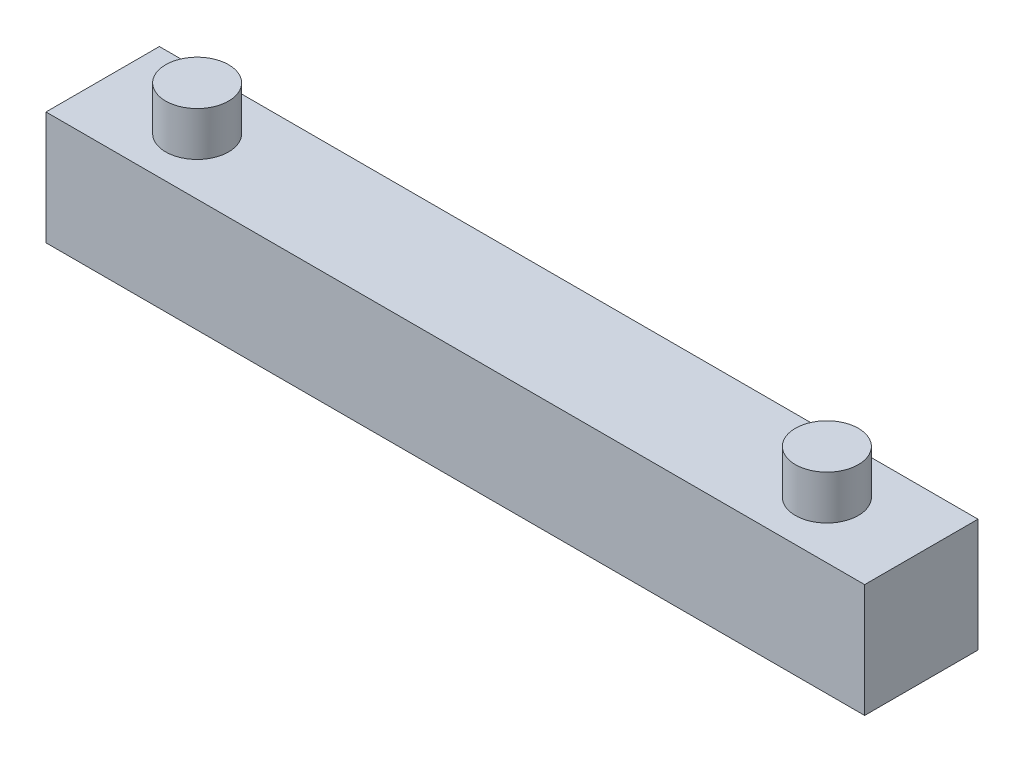
ISO-10303-21;
HEADER;
FILE_DESCRIPTION(('STEP AP214'),'2;1');
FILE_NAME('part.step','',(''),(''),'','','');
FILE_SCHEMA(('AUTOMOTIVE_DESIGN { 1 0 10303 214 1 1 1 1 }'));
ENDSEC;
DATA;
#1=APPLICATION_CONTEXT('core data for automotive mechanical design processes');
#2=APPLICATION_PROTOCOL_DEFINITION('international standard','automotive_design',2000,#1);
#3=PRODUCT_CONTEXT('',#1,'mechanical');
#4=PRODUCT('Part','Part','',(#3));
#5=PRODUCT_RELATED_PRODUCT_CATEGORY('part','',(#4));
#6=PRODUCT_DEFINITION_FORMATION('','',#4);
#7=PRODUCT_DEFINITION_CONTEXT('part definition',#1,'design');
#8=PRODUCT_DEFINITION('design','',#6,#7);
#9=PRODUCT_DEFINITION_SHAPE('','',#8);
#10=(LENGTH_UNIT() NAMED_UNIT(*) SI_UNIT(.MILLI.,.METRE.));
#11=(NAMED_UNIT(*) PLANE_ANGLE_UNIT() SI_UNIT($,.RADIAN.));
#12=(NAMED_UNIT(*) SI_UNIT($,.STERADIAN.) SOLID_ANGLE_UNIT());
#13=UNCERTAINTY_MEASURE_WITH_UNIT(LENGTH_MEASURE(1.E-05),#10,'distance_accuracy_value','');
#14=(GEOMETRIC_REPRESENTATION_CONTEXT(3) GLOBAL_UNCERTAINTY_ASSIGNED_CONTEXT((#13)) GLOBAL_UNIT_ASSIGNED_CONTEXT((#10,
#11,#12)) REPRESENTATION_CONTEXT('',''));
#15=CARTESIAN_POINT('',(0.,0.,0.));
#16=DIRECTION('',(0.,0.,1.));
#17=DIRECTION('',(1.,0.,0.));
#18=AXIS2_PLACEMENT_3D('',#15,#16,#17);
#19=CARTESIAN_POINT('',(0.,9.,0.));
#20=DIRECTION('',(1.,0.,0.));
#21=DIRECTION('',(0.,0.,-1.));
#22=AXIS2_PLACEMENT_3D('',#19,#20,#21);
#23=PLANE('',#22);
#24=DIRECTION('',(0.,0.,1.));
#25=VECTOR('',#24,1.);
#26=CARTESIAN_POINT('',(0.,0.,0.));
#27=LINE('',#26,#25);
#28=CARTESIAN_POINT('',(0.,0.,-9.));
#29=VERTEX_POINT('',#28);
#30=CARTESIAN_POINT('',(0.,0.,0.));
#31=VERTEX_POINT('',#30);
#32=EDGE_CURVE('E100',#29,#31,#27,.T.);
#33=ORIENTED_EDGE('',*,*,#32,.T.);
#34=DIRECTION('',(0.,-1.,0.));
#35=VECTOR('',#34,1.);
#36=CARTESIAN_POINT('',(0.,9.,0.));
#37=LINE('',#36,#35);
#38=CARTESIAN_POINT('',(0.,9.,0.));
#39=VERTEX_POINT('',#38);
#40=EDGE_CURVE('E91',#39,#31,#37,.T.);
#41=ORIENTED_EDGE('',*,*,#40,.F.);
#42=DIRECTION('',(0.,0.,1.));
#43=VECTOR('',#42,1.);
#44=CARTESIAN_POINT('',(0.,9.,0.));
#45=LINE('',#44,#43);
#46=CARTESIAN_POINT('',(0.,9.,-9.));
#47=VERTEX_POINT('',#46);
#48=EDGE_CURVE('E85',#47,#39,#45,.T.);
#49=ORIENTED_EDGE('',*,*,#48,.F.);
#50=DIRECTION('',(0.,-1.,0.));
#51=VECTOR('',#50,1.);
#52=CARTESIAN_POINT('',(0.,9.,-9.));
#53=LINE('',#52,#51);
#54=EDGE_CURVE('E96',#47,#29,#53,.T.);
#55=ORIENTED_EDGE('',*,*,#54,.T.);
#56=EDGE_LOOP('',(#33,#41,#49,#55));
#57=FACE_BOUND('',#56,.T.);
#58=ADVANCED_FACE('F33',(#57),#23,.F.);
#59=CARTESIAN_POINT('',(0.,9.,0.));
#60=DIRECTION('',(0.,0.,-1.));
#61=DIRECTION('',(-1.,0.,0.));
#62=AXIS2_PLACEMENT_3D('',#59,#60,#61);
#63=PLANE('',#62);
#64=DIRECTION('',(1.,0.,0.));
#65=VECTOR('',#64,1.);
#66=CARTESIAN_POINT('',(0.,0.,0.));
#67=LINE('',#66,#65);
#68=CARTESIAN_POINT('',(65.,0.,0.));
#69=VERTEX_POINT('',#68);
#70=EDGE_CURVE('E90',#31,#69,#67,.T.);
#71=ORIENTED_EDGE('',*,*,#70,.T.);
#72=DIRECTION('',(0.,-1.,0.));
#73=VECTOR('',#72,1.);
#74=CARTESIAN_POINT('',(65.,9.,0.));
#75=LINE('',#74,#73);
#76=CARTESIAN_POINT('',(65.,9.,0.));
#77=VERTEX_POINT('',#76);
#78=EDGE_CURVE('E88',#77,#69,#75,.T.);
#79=ORIENTED_EDGE('',*,*,#78,.F.);
#80=DIRECTION('',(1.,0.,0.));
#81=VECTOR('',#80,1.);
#82=CARTESIAN_POINT('',(0.,9.,0.));
#83=LINE('',#82,#81);
#84=EDGE_CURVE('E80',#39,#77,#83,.T.);
#85=ORIENTED_EDGE('',*,*,#84,.F.);
#86=ORIENTED_EDGE('',*,*,#40,.T.);
#87=EDGE_LOOP('',(#71,#79,#85,#86));
#88=FACE_BOUND('',#87,.T.);
#89=ADVANCED_FACE('F89',(#88),#63,.F.);
#90=CARTESIAN_POINT('',(65.,9.,0.));
#91=DIRECTION('',(-1.,0.,0.));
#92=DIRECTION('',(0.,0.,1.));
#93=AXIS2_PLACEMENT_3D('',#90,#91,#92);
#94=PLANE('',#93);
#95=DIRECTION('',(0.,0.,-1.));
#96=VECTOR('',#95,1.);
#97=CARTESIAN_POINT('',(65.,0.,0.));
#98=LINE('',#97,#96);
#99=CARTESIAN_POINT('',(65.,0.,-9.));
#100=VERTEX_POINT('',#99);
#101=EDGE_CURVE('E66',#69,#100,#98,.T.);
#102=ORIENTED_EDGE('',*,*,#101,.T.);
#103=DIRECTION('',(0.,-1.,0.));
#104=VECTOR('',#103,1.);
#105=CARTESIAN_POINT('',(65.,9.,-9.));
#106=LINE('',#105,#104);
#107=CARTESIAN_POINT('',(65.,9.,-9.));
#108=VERTEX_POINT('',#107);
#109=EDGE_CURVE('E92',#108,#100,#106,.T.);
#110=ORIENTED_EDGE('',*,*,#109,.F.);
#111=DIRECTION('',(0.,0.,-1.));
#112=VECTOR('',#111,1.);
#113=CARTESIAN_POINT('',(65.,9.,0.));
#114=LINE('',#113,#112);
#115=EDGE_CURVE('E83',#77,#108,#114,.T.);
#116=ORIENTED_EDGE('',*,*,#115,.F.);
#117=ORIENTED_EDGE('',*,*,#78,.T.);
#118=EDGE_LOOP('',(#102,#110,#116,#117));
#119=FACE_BOUND('',#118,.T.);
#120=ADVANCED_FACE('F94',(#119),#94,.F.);
#121=CARTESIAN_POINT('',(0.,9.,-9.));
#122=DIRECTION('',(0.,0.,1.));
#123=DIRECTION('',(1.,0.,0.));
#124=AXIS2_PLACEMENT_3D('',#121,#122,#123);
#125=PLANE('',#124);
#126=DIRECTION('',(-1.,0.,0.));
#127=VECTOR('',#126,1.);
#128=CARTESIAN_POINT('',(0.,0.,-9.));
#129=LINE('',#128,#127);
#130=EDGE_CURVE('E72',#100,#29,#129,.T.);
#131=ORIENTED_EDGE('',*,*,#130,.T.);
#132=ORIENTED_EDGE('',*,*,#54,.F.);
#133=DIRECTION('',(-1.,0.,0.));
#134=VECTOR('',#133,1.);
#135=CARTESIAN_POINT('',(0.,9.,-9.));
#136=LINE('',#135,#134);
#137=EDGE_CURVE('E49',#108,#47,#136,.T.);
#138=ORIENTED_EDGE('',*,*,#137,.F.);
#139=ORIENTED_EDGE('',*,*,#109,.T.);
#140=EDGE_LOOP('',(#131,#132,#138,#139));
#141=FACE_BOUND('',#140,.T.);
#142=ADVANCED_FACE('F116',(#141),#125,.F.);
#143=CARTESIAN_POINT('',(0.,9.,0.));
#144=DIRECTION('',(0.,-1.,0.));
#145=DIRECTION('',(0.,0.,-1.));
#146=AXIS2_PLACEMENT_3D('',#143,#144,#145);
#147=PLANE('',#146);
#148=CARTESIAN_POINT('',(57.5,9.,-4.50000000000001));
#149=DIRECTION('',(0.,-1.,0.));
#150=DIRECTION('',(0.,0.,-1.));
#151=AXIS2_PLACEMENT_3D('',#148,#149,#150);
#152=CIRCLE('',#151,2.5);
#153=CARTESIAN_POINT('',(57.5,9.,-7.00000000000001));
#154=VERTEX_POINT('',#153);
#155=EDGE_CURVE('E11',#154,#154,#152,.F.);
#156=ORIENTED_EDGE('',*,*,#155,.F.);
#157=EDGE_LOOP('',(#156));
#158=FACE_BOUND('',#157,.T.);
#159=CARTESIAN_POINT('',(7.5,9.,-4.5));
#160=DIRECTION('',(0.,-1.,0.));
#161=DIRECTION('',(0.,0.,-1.));
#162=AXIS2_PLACEMENT_3D('',#159,#160,#161);
#163=CIRCLE('',#162,2.5);
#164=CARTESIAN_POINT('',(7.5,9.,-7.));
#165=VERTEX_POINT('',#164);
#166=EDGE_CURVE('E41',#165,#165,#163,.F.);
#167=ORIENTED_EDGE('',*,*,#166,.F.);
#168=EDGE_LOOP('',(#167));
#169=FACE_BOUND('',#168,.T.);
#170=ORIENTED_EDGE('',*,*,#48,.T.);
#171=ORIENTED_EDGE('',*,*,#84,.T.);
#172=ORIENTED_EDGE('',*,*,#115,.T.);
#173=ORIENTED_EDGE('',*,*,#137,.T.);
#174=EDGE_LOOP('',(#170,#171,#172,#173));
#175=FACE_BOUND('',#174,.T.);
#176=ADVANCED_FACE('F81',(#158,#169,#175),#147,.F.);
#177=CARTESIAN_POINT('',(0.,0.,0.));
#178=DIRECTION('',(0.,-1.,0.));
#179=DIRECTION('',(0.,0.,-1.));
#180=AXIS2_PLACEMENT_3D('',#177,#178,#179);
#181=PLANE('',#180);
#182=ORIENTED_EDGE('',*,*,#32,.F.);
#183=ORIENTED_EDGE('',*,*,#130,.F.);
#184=ORIENTED_EDGE('',*,*,#101,.F.);
#185=ORIENTED_EDGE('',*,*,#70,.F.);
#186=EDGE_LOOP('',(#182,#183,#184,#185));
#187=FACE_BOUND('',#186,.T.);
#188=ADVANCED_FACE('F115',(#187),#181,.T.);
#189=CARTESIAN_POINT('',(7.5,12.5,-4.5));
#190=DIRECTION('',(0.,-1.,0.));
#191=DIRECTION('',(0.,0.,-1.));
#192=AXIS2_PLACEMENT_3D('',#189,#190,#191);
#193=CYLINDRICAL_SURFACE('',#192,2.5);
#194=CARTESIAN_POINT('',(7.5,12.5,-4.5));
#195=DIRECTION('',(0.,1.,0.));
#196=DIRECTION('',(0.,0.,1.));
#197=AXIS2_PLACEMENT_3D('',#194,#195,#196);
#198=CIRCLE('',#197,2.5);
#199=CARTESIAN_POINT('',(7.5,12.5,-2.));
#200=VERTEX_POINT('',#199);
#201=EDGE_CURVE('E103',#200,#200,#198,.T.);
#202=ORIENTED_EDGE('',*,*,#201,.F.);
#203=EDGE_LOOP('',(#202));
#204=FACE_BOUND('',#203,.T.);
#205=ORIENTED_EDGE('',*,*,#166,.T.);
#206=EDGE_LOOP('',(#205));
#207=FACE_BOUND('',#206,.T.);
#208=ADVANCED_FACE('F112',(#204,#207),#193,.T.);
#209=CARTESIAN_POINT('',(7.5,12.5,-4.5));
#210=DIRECTION('',(0.,1.,0.));
#211=DIRECTION('',(0.,0.,1.));
#212=AXIS2_PLACEMENT_3D('',#209,#210,#211);
#213=PLANE('',#212);
#214=ORIENTED_EDGE('',*,*,#201,.T.);
#215=EDGE_LOOP('',(#214));
#216=FACE_BOUND('',#215,.T.);
#217=ADVANCED_FACE('F146',(#216),#213,.T.);
#218=CARTESIAN_POINT('',(57.5,12.5,-4.50000000000001));
#219=DIRECTION('',(0.,-1.,0.));
#220=DIRECTION('',(0.,0.,-1.));
#221=AXIS2_PLACEMENT_3D('',#218,#219,#220);
#222=CYLINDRICAL_SURFACE('',#221,2.5);
#223=CARTESIAN_POINT('',(57.5,12.5,-4.50000000000001));
#224=DIRECTION('',(0.,1.,0.));
#225=DIRECTION('',(0.,0.,-1.));
#226=AXIS2_PLACEMENT_3D('',#223,#224,#225);
#227=CIRCLE('',#226,2.5);
#228=CARTESIAN_POINT('',(57.5,12.5,-7.00000000000001));
#229=VERTEX_POINT('',#228);
#230=EDGE_CURVE('E137',#229,#229,#227,.T.);
#231=ORIENTED_EDGE('',*,*,#230,.F.);
#232=EDGE_LOOP('',(#231));
#233=FACE_BOUND('',#232,.T.);
#234=ORIENTED_EDGE('',*,*,#155,.T.);
#235=EDGE_LOOP('',(#234));
#236=FACE_BOUND('',#235,.T.);
#237=ADVANCED_FACE('F143',(#233,#236),#222,.T.);
#238=CARTESIAN_POINT('',(57.5,12.5,-4.50000000000001));
#239=DIRECTION('',(0.,-1.,0.));
#240=DIRECTION('',(0.,0.,-1.));
#241=AXIS2_PLACEMENT_3D('',#238,#239,#240);
#242=PLANE('',#241);
#243=ORIENTED_EDGE('',*,*,#230,.T.);
#244=EDGE_LOOP('',(#243));
#245=FACE_BOUND('',#244,.T.);
#246=ADVANCED_FACE('F141',(#245),#242,.F.);
#247=CLOSED_SHELL('',(#58,#89,#120,#142,#176,#188,#208,#217,#237,#246));
#248=MANIFOLD_SOLID_BREP('B2',#247);
#249=ADVANCED_BREP_SHAPE_REPRESENTATION('',(#18,#248),#14);
#250=SHAPE_DEFINITION_REPRESENTATION(#9,#249);
ENDSEC;
END-ISO-10303-21;
